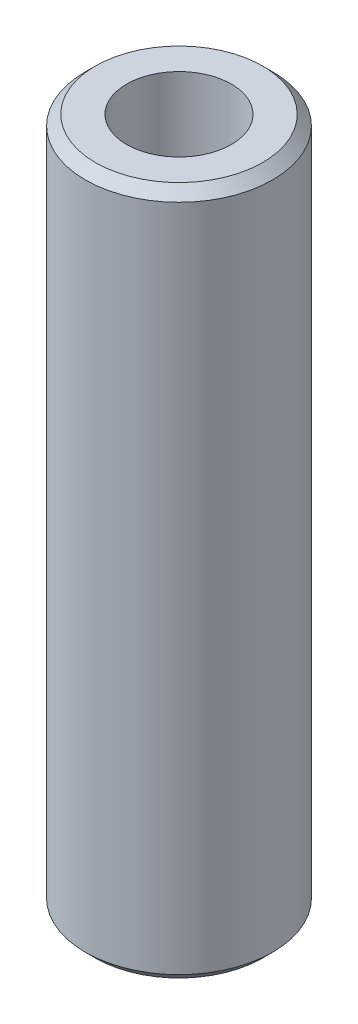
ISO-10303-21;
HEADER;
FILE_DESCRIPTION(('STEP AP214'),'2;1');
FILE_NAME('part.step','',(''),(''),'','','');
FILE_SCHEMA(('AUTOMOTIVE_DESIGN { 1 0 10303 214 1 1 1 1 }'));
ENDSEC;
DATA;
#1=APPLICATION_CONTEXT('core data for automotive mechanical design processes');
#2=APPLICATION_PROTOCOL_DEFINITION('international standard','automotive_design',2000,#1);
#3=PRODUCT_CONTEXT('',#1,'mechanical');
#4=PRODUCT('Part','Part','',(#3));
#5=PRODUCT_RELATED_PRODUCT_CATEGORY('part','',(#4));
#6=PRODUCT_DEFINITION_FORMATION('','',#4);
#7=PRODUCT_DEFINITION_CONTEXT('part definition',#1,'design');
#8=PRODUCT_DEFINITION('design','',#6,#7);
#9=PRODUCT_DEFINITION_SHAPE('','',#8);
#10=(LENGTH_UNIT() NAMED_UNIT(*) SI_UNIT(.MILLI.,.METRE.));
#11=(NAMED_UNIT(*) PLANE_ANGLE_UNIT() SI_UNIT($,.RADIAN.));
#12=(NAMED_UNIT(*) SI_UNIT($,.STERADIAN.) SOLID_ANGLE_UNIT());
#13=UNCERTAINTY_MEASURE_WITH_UNIT(LENGTH_MEASURE(1.E-05),#10,'distance_accuracy_value','');
#14=(GEOMETRIC_REPRESENTATION_CONTEXT(3) GLOBAL_UNCERTAINTY_ASSIGNED_CONTEXT((#13)) GLOBAL_UNIT_ASSIGNED_CONTEXT((#10,
#11,#12)) REPRESENTATION_CONTEXT('',''));
#15=CARTESIAN_POINT('',(0.,0.,0.));
#16=DIRECTION('',(0.,0.,1.));
#17=DIRECTION('',(1.,0.,0.));
#18=AXIS2_PLACEMENT_3D('',#15,#16,#17);
#19=CARTESIAN_POINT('',(0.,331.012194231658,0.));
#20=DIRECTION('',(0.,-1.,0.));
#21=DIRECTION('',(0.,0.,-1.));
#22=AXIS2_PLACEMENT_3D('',#19,#20,#21);
#23=CYLINDRICAL_SURFACE('',#22,45.);
#24=CARTESIAN_POINT('',(0.,326.197414085442,0.));
#25=DIRECTION('',(0.,1.,0.));
#26=DIRECTION('',(0.,0.,1.));
#27=AXIS2_PLACEMENT_3D('',#24,#25,#26);
#28=CIRCLE('',#27,45.);
#29=CARTESIAN_POINT('',(0.,326.197414085442,45.));
#30=VERTEX_POINT('',#29);
#31=EDGE_CURVE('E50',#30,#30,#28,.F.);
#32=ORIENTED_EDGE('',*,*,#31,.T.);
#33=EDGE_LOOP('',(#32));
#34=FACE_BOUND('',#33,.T.);
#35=CARTESIAN_POINT('',(0.,4.81478014621611,0.));
#36=DIRECTION('',(0.,1.,0.));
#37=DIRECTION('',(0.,0.,1.));
#38=AXIS2_PLACEMENT_3D('',#35,#36,#37);
#39=CIRCLE('',#38,45.);
#40=CARTESIAN_POINT('',(0.,4.81478014621611,45.));
#41=VERTEX_POINT('',#40);
#42=EDGE_CURVE('E51',#41,#41,#39,.T.);
#43=ORIENTED_EDGE('',*,*,#42,.T.);
#44=EDGE_LOOP('',(#43));
#45=FACE_BOUND('',#44,.T.);
#46=ADVANCED_FACE('F39',(#34,#45),#23,.T.);
#47=CARTESIAN_POINT('',(0.,331.012194231658,0.));
#48=DIRECTION('',(0.,1.,0.));
#49=DIRECTION('',(0.,0.,1.));
#50=AXIS2_PLACEMENT_3D('',#47,#48,#49);
#51=PLANE('',#50);
#52=CARTESIAN_POINT('',(0.,331.012194231658,0.));
#53=DIRECTION('',(0.,1.,0.));
#54=DIRECTION('',(0.,0.,1.));
#55=AXIS2_PLACEMENT_3D('',#52,#53,#54);
#56=CIRCLE('',#55,40.185219853784);
#57=CARTESIAN_POINT('',(0.,331.012194231658,40.185219853784));
#58=VERTEX_POINT('',#57);
#59=EDGE_CURVE('E54',#58,#58,#56,.T.);
#60=ORIENTED_EDGE('',*,*,#59,.T.);
#61=EDGE_LOOP('',(#60));
#62=FACE_BOUND('',#61,.T.);
#63=CARTESIAN_POINT('',(0.,331.012194231658,0.));
#64=DIRECTION('',(0.,1.,0.));
#65=DIRECTION('',(0.,0.,1.));
#66=AXIS2_PLACEMENT_3D('',#63,#64,#65);
#67=CIRCLE('',#66,25.1619238720785);
#68=CARTESIAN_POINT('',(0.,331.012194231658,25.1619238720785));
#69=VERTEX_POINT('',#68);
#70=EDGE_CURVE('E58',#69,#69,#67,.T.);
#71=ORIENTED_EDGE('',*,*,#70,.F.);
#72=EDGE_LOOP('',(#71));
#73=FACE_BOUND('',#72,.T.);
#74=ADVANCED_FACE('F69',(#62,#73),#51,.T.);
#75=CARTESIAN_POINT('',(0.,0.,0.));
#76=DIRECTION('',(0.,1.,0.));
#77=DIRECTION('',(0.,0.,1.));
#78=AXIS2_PLACEMENT_3D('',#75,#76,#77);
#79=PLANE('',#78);
#80=CARTESIAN_POINT('',(0.,0.,0.));
#81=DIRECTION('',(0.,1.,0.));
#82=DIRECTION('',(0.,0.,1.));
#83=AXIS2_PLACEMENT_3D('',#80,#81,#82);
#84=CIRCLE('',#83,40.1852198537839);
#85=CARTESIAN_POINT('',(0.,0.,40.1852198537839));
#86=VERTEX_POINT('',#85);
#87=EDGE_CURVE('E10',#86,#86,#84,.F.);
#88=ORIENTED_EDGE('',*,*,#87,.T.);
#89=EDGE_LOOP('',(#88));
#90=FACE_BOUND('',#89,.T.);
#91=CARTESIAN_POINT('',(0.,0.,0.));
#92=DIRECTION('',(0.,1.,0.));
#93=DIRECTION('',(0.,0.,1.));
#94=AXIS2_PLACEMENT_3D('',#91,#92,#93);
#95=CIRCLE('',#94,25.1619238720785);
#96=CARTESIAN_POINT('',(0.,0.,25.1619238720785));
#97=VERTEX_POINT('',#96);
#98=EDGE_CURVE('E63',#97,#97,#95,.T.);
#99=ORIENTED_EDGE('',*,*,#98,.T.);
#100=EDGE_LOOP('',(#99));
#101=FACE_BOUND('',#100,.T.);
#102=ADVANCED_FACE('F75',(#90,#101),#79,.F.);
#103=CARTESIAN_POINT('',(0.,331.012194231658,0.));
#104=DIRECTION('',(0.,-1.,0.));
#105=DIRECTION('',(0.,0.,-1.));
#106=AXIS2_PLACEMENT_3D('',#103,#104,#105);
#107=CYLINDRICAL_SURFACE('',#106,25.1619238720785);
#108=ORIENTED_EDGE('',*,*,#70,.T.);
#109=EDGE_LOOP('',(#108));
#110=FACE_BOUND('',#109,.T.);
#111=ORIENTED_EDGE('',*,*,#98,.F.);
#112=EDGE_LOOP('',(#111));
#113=FACE_BOUND('',#112,.T.);
#114=ADVANCED_FACE('F70',(#110,#113),#107,.F.);
#115=CARTESIAN_POINT('',(0.,331.012194231658,0.));
#116=DIRECTION('',(0.,-1.,0.));
#117=DIRECTION('',(0.,0.,-1.));
#118=AXIS2_PLACEMENT_3D('',#115,#116,#117);
#119=CONICAL_SURFACE('',#118,40.185219853784,0.785398163397445);
#120=ORIENTED_EDGE('',*,*,#31,.F.);
#121=EDGE_LOOP('',(#120));
#122=FACE_BOUND('',#121,.T.);
#123=ORIENTED_EDGE('',*,*,#59,.F.);
#124=EDGE_LOOP('',(#123));
#125=FACE_BOUND('',#124,.T.);
#126=ADVANCED_FACE('F81',(#122,#125),#119,.T.);
#127=CARTESIAN_POINT('',(0.,4.81478014621611,0.));
#128=DIRECTION('',(0.,1.,0.));
#129=DIRECTION('',(0.,0.,1.));
#130=AXIS2_PLACEMENT_3D('',#127,#128,#129);
#131=CONICAL_SURFACE('',#130,45.,0.785398163397451);
#132=ORIENTED_EDGE('',*,*,#87,.F.);
#133=EDGE_LOOP('',(#132));
#134=FACE_BOUND('',#133,.T.);
#135=ORIENTED_EDGE('',*,*,#42,.F.);
#136=EDGE_LOOP('',(#135));
#137=FACE_BOUND('',#136,.T.);
#138=ADVANCED_FACE('F45',(#134,#137),#131,.T.);
#139=CLOSED_SHELL('',(#46,#74,#102,#114,#126,#138));
#140=MANIFOLD_SOLID_BREP('B2',#139);
#141=ADVANCED_BREP_SHAPE_REPRESENTATION('',(#18,#140),#14);
#142=SHAPE_DEFINITION_REPRESENTATION(#9,#141);
ENDSEC;
END-ISO-10303-21;
